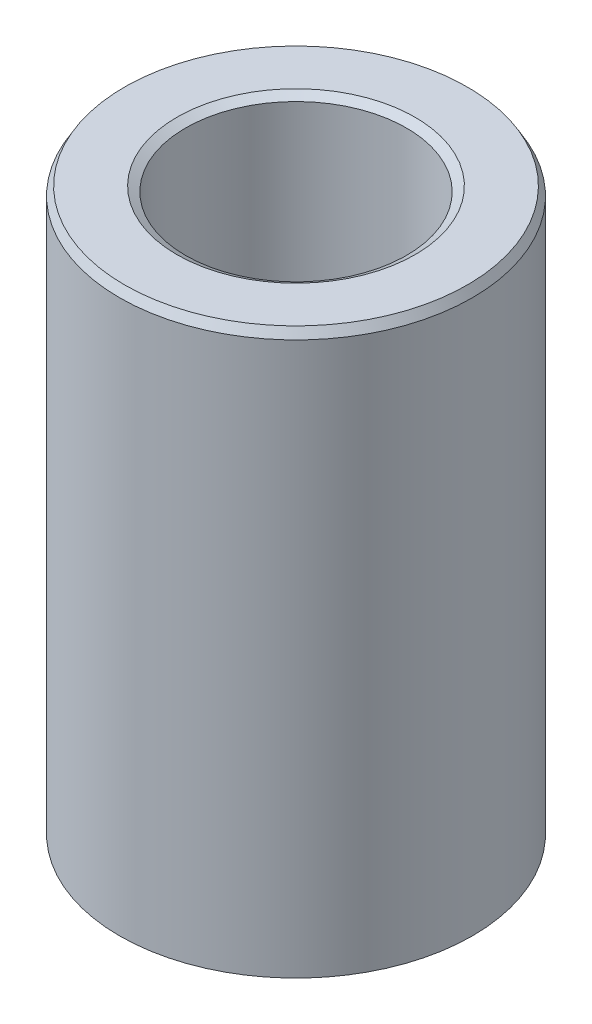
ISO-10303-21;
HEADER;
FILE_DESCRIPTION(('STEP AP214'),'2;1');
FILE_NAME('part.step','',(''),(''),'','','');
FILE_SCHEMA(('AUTOMOTIVE_DESIGN { 1 0 10303 214 1 1 1 1 }'));
ENDSEC;
DATA;
#1=APPLICATION_CONTEXT('core data for automotive mechanical design processes');
#2=APPLICATION_PROTOCOL_DEFINITION('international standard','automotive_design',2000,#1);
#3=PRODUCT_CONTEXT('',#1,'mechanical');
#4=PRODUCT('Part','Part','',(#3));
#5=PRODUCT_RELATED_PRODUCT_CATEGORY('part','',(#4));
#6=PRODUCT_DEFINITION_FORMATION('','',#4);
#7=PRODUCT_DEFINITION_CONTEXT('part definition',#1,'design');
#8=PRODUCT_DEFINITION('design','',#6,#7);
#9=PRODUCT_DEFINITION_SHAPE('','',#8);
#10=(LENGTH_UNIT() NAMED_UNIT(*) SI_UNIT(.MILLI.,.METRE.));
#11=(NAMED_UNIT(*) PLANE_ANGLE_UNIT() SI_UNIT($,.RADIAN.));
#12=(NAMED_UNIT(*) SI_UNIT($,.STERADIAN.) SOLID_ANGLE_UNIT());
#13=UNCERTAINTY_MEASURE_WITH_UNIT(LENGTH_MEASURE(1.E-05),#10,'distance_accuracy_value','');
#14=(GEOMETRIC_REPRESENTATION_CONTEXT(3) GLOBAL_UNCERTAINTY_ASSIGNED_CONTEXT((#13)) GLOBAL_UNIT_ASSIGNED_CONTEXT((#10,
#11,#12)) REPRESENTATION_CONTEXT('',''));
#15=CARTESIAN_POINT('',(0.,0.,0.));
#16=DIRECTION('',(0.,0.,1.));
#17=DIRECTION('',(1.,0.,0.));
#18=AXIS2_PLACEMENT_3D('',#15,#16,#17);
#19=CARTESIAN_POINT('',(0.,88.2808353530103,0.));
#20=DIRECTION('',(0.,-1.,0.));
#21=DIRECTION('',(0.,0.,-1.));
#22=AXIS2_PLACEMENT_3D('',#19,#20,#21);
#23=CYLINDRICAL_SURFACE('',#22,27.5);
#24=CARTESIAN_POINT('',(0.,0.776583046499732,0.));
#25=DIRECTION('',(0.,1.,0.));
#26=DIRECTION('',(0.,0.,1.));
#27=AXIS2_PLACEMENT_3D('',#24,#25,#26);
#28=CIRCLE('',#27,27.5);
#29=CARTESIAN_POINT('',(0.,0.776583046499732,27.5));
#30=VERTEX_POINT('',#29);
#31=EDGE_CURVE('E10',#30,#30,#28,.T.);
#32=ORIENTED_EDGE('',*,*,#31,.T.);
#33=EDGE_LOOP('',(#32));
#34=FACE_BOUND('',#33,.T.);
#35=CARTESIAN_POINT('',(0.,86.9357540601761,0.));
#36=DIRECTION('',(0.,1.,0.));
#37=DIRECTION('',(0.,0.,1.));
#38=AXIS2_PLACEMENT_3D('',#35,#36,#37);
#39=CIRCLE('',#38,27.5);
#40=CARTESIAN_POINT('',(0.,86.9357540601761,27.5));
#41=VERTEX_POINT('',#40);
#42=EDGE_CURVE('E50',#41,#41,#39,.F.);
#43=ORIENTED_EDGE('',*,*,#42,.T.);
#44=EDGE_LOOP('',(#43));
#45=FACE_BOUND('',#44,.T.);
#46=ADVANCED_FACE('F39',(#34,#45),#23,.T.);
#47=CARTESIAN_POINT('',(0.,88.2808353530103,0.));
#48=DIRECTION('',(0.,1.,0.));
#49=DIRECTION('',(0.,0.,1.));
#50=AXIS2_PLACEMENT_3D('',#47,#48,#49);
#51=PLANE('',#50);
#52=CARTESIAN_POINT('',(0.,88.2808353530103,0.));
#53=DIRECTION('',(0.,1.,0.));
#54=DIRECTION('',(0.,0.,1.));
#55=AXIS2_PLACEMENT_3D('',#52,#53,#54);
#56=CIRCLE('',#55,18.5659759089902);
#57=CARTESIAN_POINT('',(0.,88.2808353530103,18.5659759089902));
#58=VERTEX_POINT('',#57);
#59=EDGE_CURVE('E58',#58,#58,#56,.F.);
#60=ORIENTED_EDGE('',*,*,#59,.T.);
#61=EDGE_LOOP('',(#60));
#62=FACE_BOUND('',#61,.T.);
#63=CARTESIAN_POINT('',(0.,88.2808353530103,0.));
#64=DIRECTION('',(0.,1.,0.));
#65=DIRECTION('',(0.,0.,1.));
#66=AXIS2_PLACEMENT_3D('',#63,#64,#65);
#67=CIRCLE('',#66,26.7234169535002);
#68=CARTESIAN_POINT('',(0.,88.2808353530103,26.7234169535002));
#69=VERTEX_POINT('',#68);
#70=EDGE_CURVE('E61',#69,#69,#67,.T.);
#71=ORIENTED_EDGE('',*,*,#70,.T.);
#72=EDGE_LOOP('',(#71));
#73=FACE_BOUND('',#72,.T.);
#74=ADVANCED_FACE('F88',(#62,#73),#51,.T.);
#75=CARTESIAN_POINT('',(0.,0.,0.));
#76=DIRECTION('',(0.,1.,0.));
#77=DIRECTION('',(0.,0.,1.));
#78=AXIS2_PLACEMENT_3D('',#75,#76,#77);
#79=PLANE('',#78);
#80=CARTESIAN_POINT('',(0.,0.,0.));
#81=DIRECTION('',(0.,1.,0.));
#82=DIRECTION('',(0.,0.,1.));
#83=AXIS2_PLACEMENT_3D('',#80,#81,#82);
#84=CIRCLE('',#83,17.9974776626558);
#85=CARTESIAN_POINT('',(0.,0.,17.9974776626558));
#86=VERTEX_POINT('',#85);
#87=EDGE_CURVE('E51',#86,#86,#84,.T.);
#88=ORIENTED_EDGE('',*,*,#87,.T.);
#89=EDGE_LOOP('',(#88));
#90=FACE_BOUND('',#89,.T.);
#91=CARTESIAN_POINT('',(0.,0.,0.));
#92=DIRECTION('',(0.,1.,0.));
#93=DIRECTION('',(0.,0.,1.));
#94=AXIS2_PLACEMENT_3D('',#91,#92,#93);
#95=CIRCLE('',#94,26.1549187071658);
#96=CARTESIAN_POINT('',(0.,0.,26.1549187071658));
#97=VERTEX_POINT('',#96);
#98=EDGE_CURVE('E54',#97,#97,#95,.F.);
#99=ORIENTED_EDGE('',*,*,#98,.T.);
#100=EDGE_LOOP('',(#99));
#101=FACE_BOUND('',#100,.T.);
#102=ADVANCED_FACE('F83',(#90,#101),#79,.F.);
#103=CARTESIAN_POINT('',(0.,88.2808353530103,0.));
#104=DIRECTION('',(0.,-1.,0.));
#105=DIRECTION('',(0.,0.,-1.));
#106=AXIS2_PLACEMENT_3D('',#103,#104,#105);
#107=CYLINDRICAL_SURFACE('',#106,17.220894616156);
#108=CARTESIAN_POINT('',(0.,87.5042523065106,0.));
#109=DIRECTION('',(0.,1.,0.));
#110=DIRECTION('',(0.,0.,1.));
#111=AXIS2_PLACEMENT_3D('',#108,#109,#110);
#112=CIRCLE('',#111,17.220894616156);
#113=CARTESIAN_POINT('',(0.,87.5042523065106,17.220894616156));
#114=VERTEX_POINT('',#113);
#115=EDGE_CURVE('E67',#114,#114,#112,.T.);
#116=ORIENTED_EDGE('',*,*,#115,.T.);
#117=EDGE_LOOP('',(#116));
#118=FACE_BOUND('',#117,.T.);
#119=CARTESIAN_POINT('',(0.,1.3450812928342,0.));
#120=DIRECTION('',(0.,1.,0.));
#121=DIRECTION('',(0.,0.,1.));
#122=AXIS2_PLACEMENT_3D('',#119,#120,#121);
#123=CIRCLE('',#122,17.220894616156);
#124=CARTESIAN_POINT('',(0.,1.3450812928342,17.220894616156));
#125=VERTEX_POINT('',#124);
#126=EDGE_CURVE('E69',#125,#125,#123,.F.);
#127=ORIENTED_EDGE('',*,*,#126,.T.);
#128=EDGE_LOOP('',(#127));
#129=FACE_BOUND('',#128,.T.);
#130=ADVANCED_FACE('F71',(#118,#129),#107,.F.);
#131=CARTESIAN_POINT('',(0.,87.5042523065106,0.));
#132=DIRECTION('',(0.,1.,0.));
#133=DIRECTION('',(0.,0.,1.));
#134=AXIS2_PLACEMENT_3D('',#131,#132,#133);
#135=CONICAL_SURFACE('',#134,17.220894616156,1.0471975511966);
#136=ORIENTED_EDGE('',*,*,#59,.F.);
#137=EDGE_LOOP('',(#136));
#138=FACE_BOUND('',#137,.T.);
#139=ORIENTED_EDGE('',*,*,#115,.F.);
#140=EDGE_LOOP('',(#139));
#141=FACE_BOUND('',#140,.T.);
#142=ADVANCED_FACE('F77',(#138,#141),#135,.F.);
#143=CARTESIAN_POINT('',(0.,0.,0.));
#144=DIRECTION('',(0.,-1.,0.));
#145=DIRECTION('',(0.,0.,-1.));
#146=AXIS2_PLACEMENT_3D('',#143,#144,#145);
#147=CONICAL_SURFACE('',#146,17.9974776626558,0.523598775598294);
#148=ORIENTED_EDGE('',*,*,#126,.F.);
#149=EDGE_LOOP('',(#148));
#150=FACE_BOUND('',#149,.T.);
#151=ORIENTED_EDGE('',*,*,#87,.F.);
#152=EDGE_LOOP('',(#151));
#153=FACE_BOUND('',#152,.T.);
#154=ADVANCED_FACE('F73',(#150,#153),#147,.F.);
#155=CARTESIAN_POINT('',(0.,0.776583046499732,0.));
#156=DIRECTION('',(0.,1.,0.));
#157=DIRECTION('',(0.,0.,1.));
#158=AXIS2_PLACEMENT_3D('',#155,#156,#157);
#159=CONICAL_SURFACE('',#158,27.5,1.0471975511966);
#160=ORIENTED_EDGE('',*,*,#98,.F.);
#161=EDGE_LOOP('',(#160));
#162=FACE_BOUND('',#161,.T.);
#163=ORIENTED_EDGE('',*,*,#31,.F.);
#164=EDGE_LOOP('',(#163));
#165=FACE_BOUND('',#164,.T.);
#166=ADVANCED_FACE('F76',(#162,#165),#159,.T.);
#167=CARTESIAN_POINT('',(0.,88.2808353530103,0.));
#168=DIRECTION('',(0.,-1.,0.));
#169=DIRECTION('',(0.,0.,-1.));
#170=AXIS2_PLACEMENT_3D('',#167,#168,#169);
#171=CONICAL_SURFACE('',#170,26.7234169535002,0.523598775598299);
#172=ORIENTED_EDGE('',*,*,#42,.F.);
#173=EDGE_LOOP('',(#172));
#174=FACE_BOUND('',#173,.T.);
#175=ORIENTED_EDGE('',*,*,#70,.F.);
#176=EDGE_LOOP('',(#175));
#177=FACE_BOUND('',#176,.T.);
#178=ADVANCED_FACE('F45',(#174,#177),#171,.T.);
#179=CLOSED_SHELL('',(#46,#74,#102,#130,#142,#154,#166,#178));
#180=MANIFOLD_SOLID_BREP('B2',#179);
#181=ADVANCED_BREP_SHAPE_REPRESENTATION('',(#18,#180),#14);
#182=SHAPE_DEFINITION_REPRESENTATION(#9,#181);
ENDSEC;
END-ISO-10303-21;
